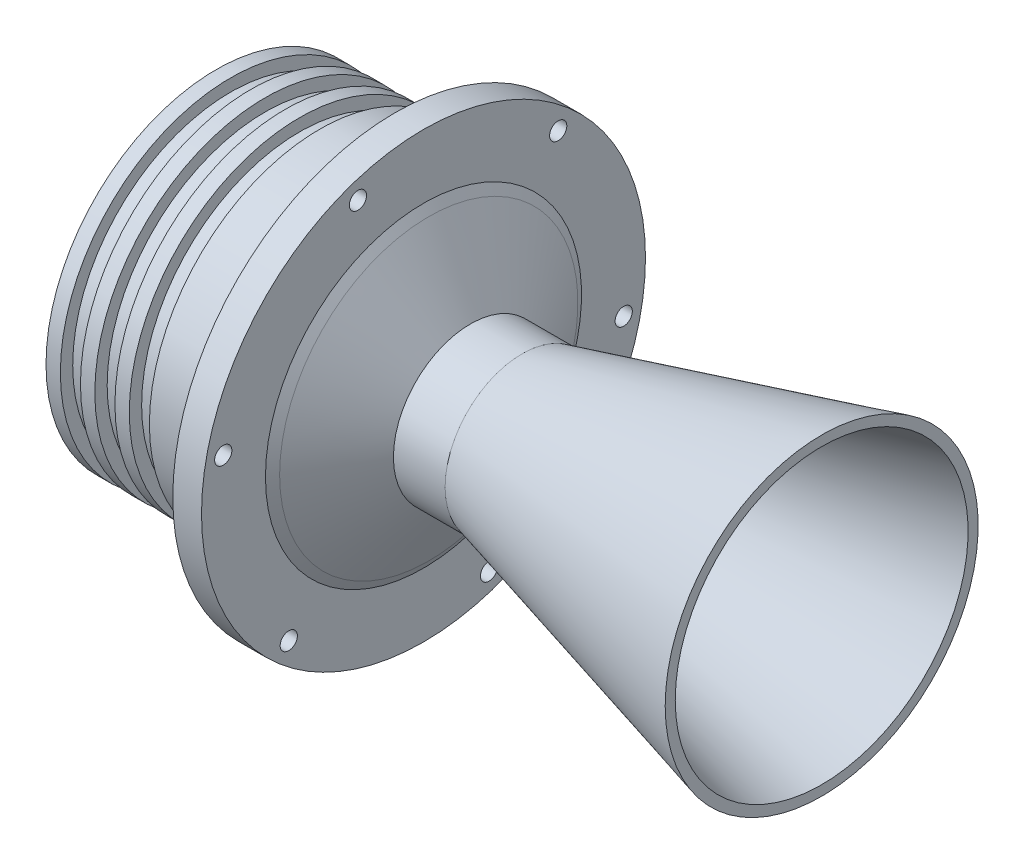
ISO-10303-21;
HEADER;
FILE_DESCRIPTION(('STEP AP214'),'2;1');
FILE_NAME('part.step','',(''),(''),'','','');
FILE_SCHEMA(('AUTOMOTIVE_DESIGN { 1 0 10303 214 1 1 1 1 }'));
ENDSEC;
DATA;
#1=APPLICATION_CONTEXT('core data for automotive mechanical design processes');
#2=APPLICATION_PROTOCOL_DEFINITION('international standard','automotive_design',2000,#1);
#3=PRODUCT_CONTEXT('',#1,'mechanical');
#4=PRODUCT('Part','Part','',(#3));
#5=PRODUCT_RELATED_PRODUCT_CATEGORY('part','',(#4));
#6=PRODUCT_DEFINITION_FORMATION('','',#4);
#7=PRODUCT_DEFINITION_CONTEXT('part definition',#1,'design');
#8=PRODUCT_DEFINITION('design','',#6,#7);
#9=PRODUCT_DEFINITION_SHAPE('','',#8);
#10=(LENGTH_UNIT() NAMED_UNIT(*) SI_UNIT(.MILLI.,.METRE.));
#11=(NAMED_UNIT(*) PLANE_ANGLE_UNIT() SI_UNIT($,.RADIAN.));
#12=(NAMED_UNIT(*) SI_UNIT($,.STERADIAN.) SOLID_ANGLE_UNIT());
#13=UNCERTAINTY_MEASURE_WITH_UNIT(LENGTH_MEASURE(1.E-05),#10,'distance_accuracy_value','');
#14=(GEOMETRIC_REPRESENTATION_CONTEXT(3) GLOBAL_UNCERTAINTY_ASSIGNED_CONTEXT((#13)) GLOBAL_UNIT_ASSIGNED_CONTEXT((#10,
#11,#12)) REPRESENTATION_CONTEXT('',''));
#15=CARTESIAN_POINT('',(0.,0.,0.));
#16=DIRECTION('',(0.,0.,1.));
#17=DIRECTION('',(1.,0.,0.));
#18=AXIS2_PLACEMENT_3D('',#15,#16,#17);
#19=CARTESIAN_POINT('',(-18.0393306872222,0.,0.));
#20=DIRECTION('',(1.,0.,0.));
#21=DIRECTION('',(0.,0.,-1.));
#22=AXIS2_PLACEMENT_3D('',#19,#20,#21);
#23=CONICAL_SURFACE('',#22,17.7679491924311,0.26179938779915);
#24=CARTESIAN_POINT('',(105.960669312778,0.,0.));
#25=DIRECTION('',(-1.,0.,0.));
#26=DIRECTION('',(0.,0.,1.));
#27=AXIS2_PLACEMENT_3D('',#24,#25,#26);
#28=CIRCLE('',#27,50.9936490538905);
#29=CARTESIAN_POINT('',(105.960669312778,0.,50.9936490538905));
#30=VERTEX_POINT('',#29);
#31=EDGE_CURVE('E81',#30,#30,#28,.T.);
#32=ORIENTED_EDGE('',*,*,#31,.F.);
#33=EDGE_LOOP('',(#32));
#34=FACE_BOUND('',#33,.T.);
#35=CARTESIAN_POINT('',(-18.0393306872222,0.,0.));
#36=DIRECTION('',(-1.,0.,0.));
#37=DIRECTION('',(0.,0.,1.));
#38=AXIS2_PLACEMENT_3D('',#35,#36,#37);
#39=CIRCLE('',#38,17.7679491924311);
#40=CARTESIAN_POINT('',(-18.0393306872222,0.,17.7679491924311));
#41=VERTEX_POINT('',#40);
#42=EDGE_CURVE('E10',#41,#41,#39,.T.);
#43=ORIENTED_EDGE('',*,*,#42,.T.);
#44=EDGE_LOOP('',(#43));
#45=FACE_BOUND('',#44,.T.);
#46=ADVANCED_FACE('F33',(#34,#45),#23,.F.);
#47=CARTESIAN_POINT('',(-18.5624081703552,0.,0.));
#48=DIRECTION('',(-1.,0.,0.));
#49=DIRECTION('',(0.,0.,1.));
#50=AXIS2_PLACEMENT_3D('',#47,#48,#49);
#51=TOROIDAL_SURFACE('',#50,18.9465103355456,1.28942484132275);
#52=ORIENTED_EDGE('',*,*,#42,.F.);
#53=EDGE_LOOP('',(#52));
#54=FACE_BOUND('',#53,.T.);
#55=CARTESIAN_POINT('',(-19.2831961369788,0.,0.));
#56=DIRECTION('',(-1.,0.,0.));
#57=DIRECTION('',(0.,0.,1.));
#58=AXIS2_PLACEMENT_3D('',#55,#56,#57);
#59=CIRCLE('',#58,17.877360613294);
#60=CARTESIAN_POINT('',(-19.2831961369788,0.,17.877360613294));
#61=VERTEX_POINT('',#60);
#62=EDGE_CURVE('E40',#61,#61,#59,.T.);
#63=ORIENTED_EDGE('',*,*,#62,.T.);
#64=EDGE_LOOP('',(#63));
#65=FACE_BOUND('',#64,.T.);
#66=ADVANCED_FACE('F305',(#54,#65),#51,.T.);
#67=CARTESIAN_POINT('',(-36.9711818397024,0.,0.));
#68=DIRECTION('',(-1.,0.,0.));
#69=DIRECTION('',(0.,0.,1.));
#70=AXIS2_PLACEMENT_3D('',#67,#68,#69);
#71=CONICAL_SURFACE('',#70,48.5138505339633,1.0471975511966);
#72=ORIENTED_EDGE('',*,*,#62,.F.);
#73=EDGE_LOOP('',(#72));
#74=FACE_BOUND('',#73,.T.);
#75=CARTESIAN_POINT('',(-36.9711818397024,0.,0.));
#76=DIRECTION('',(-1.,0.,0.));
#77=DIRECTION('',(0.,0.,1.));
#78=AXIS2_PLACEMENT_3D('',#75,#76,#77);
#79=CIRCLE('',#78,48.5138505339633);
#80=CARTESIAN_POINT('',(-36.9711818397024,0.,48.5138505339633));
#81=VERTEX_POINT('',#80);
#82=EDGE_CURVE('E45',#81,#81,#79,.T.);
#83=ORIENTED_EDGE('',*,*,#82,.T.);
#84=EDGE_LOOP('',(#83));
#85=FACE_BOUND('',#84,.T.);
#86=ADVANCED_FACE('F155',(#74,#85),#71,.F.);
#87=CARTESIAN_POINT('',(-40.1019276223522,0.,0.));
#88=DIRECTION('',(-1.,0.,0.));
#89=DIRECTION('',(0.,0.,1.));
#90=AXIS2_PLACEMENT_3D('',#87,#88,#89);
#91=TOROIDAL_SURFACE('',#90,45.9802034497686,4.02752240252339);
#92=ORIENTED_EDGE('',*,*,#82,.F.);
#93=EDGE_LOOP('',(#92));
#94=FACE_BOUND('',#93,.T.);
#95=CARTESIAN_POINT('',(-39.8525836880452,0.,0.));
#96=DIRECTION('',(-1.,0.,0.));
#97=DIRECTION('',(0.,0.,1.));
#98=AXIS2_PLACEMENT_3D('',#95,#96,#97);
#99=CIRCLE('',#98,50.);
#100=CARTESIAN_POINT('',(-39.8525836880452,0.,50.));
#101=VERTEX_POINT('',#100);
#102=EDGE_CURVE('E150',#101,#101,#99,.T.);
#103=ORIENTED_EDGE('',*,*,#102,.T.);
#104=EDGE_LOOP('',(#103));
#105=FACE_BOUND('',#104,.T.);
#106=ADVANCED_FACE('F157',(#94,#105),#91,.F.);
#107=CARTESIAN_POINT('',(-113.603789782245,0.,0.));
#108=DIRECTION('',(-1.,0.,0.));
#109=DIRECTION('',(0.,0.,1.));
#110=AXIS2_PLACEMENT_3D('',#107,#108,#109);
#111=CYLINDRICAL_SURFACE('',#110,50.);
#112=ORIENTED_EDGE('',*,*,#102,.F.);
#113=EDGE_LOOP('',(#112));
#114=FACE_BOUND('',#113,.T.);
#115=CARTESIAN_POINT('',(-99.850994621969,0.,0.));
#116=DIRECTION('',(-1.,0.,0.));
#117=DIRECTION('',(0.,0.,1.));
#118=AXIS2_PLACEMENT_3D('',#115,#116,#117);
#119=CIRCLE('',#118,50.);
#120=CARTESIAN_POINT('',(-99.850994621969,0.,50.));
#121=VERTEX_POINT('',#120);
#122=EDGE_CURVE('E147',#121,#121,#119,.T.);
#123=ORIENTED_EDGE('',*,*,#122,.T.);
#124=EDGE_LOOP('',(#123));
#125=FACE_BOUND('',#124,.T.);
#126=ADVANCED_FACE('F160',(#114,#125),#111,.F.);
#127=CARTESIAN_POINT('',(-104.850994621969,0.,0.));
#128=DIRECTION('',(-1.,0.,0.));
#129=DIRECTION('',(0.,0.,1.));
#130=AXIS2_PLACEMENT_3D('',#127,#128,#129);
#131=CONICAL_SURFACE('',#130,59.3,1.07749639460582);
#132=ORIENTED_EDGE('',*,*,#122,.F.);
#133=EDGE_LOOP('',(#132));
#134=FACE_BOUND('',#133,.T.);
#135=CARTESIAN_POINT('',(-104.850994621969,0.,0.));
#136=DIRECTION('',(-1.,0.,0.));
#137=DIRECTION('',(0.,0.,1.));
#138=AXIS2_PLACEMENT_3D('',#135,#136,#137);
#139=CIRCLE('',#138,59.3);
#140=CARTESIAN_POINT('',(-104.850994621969,0.,59.3));
#141=VERTEX_POINT('',#140);
#142=EDGE_CURVE('E144',#141,#141,#139,.T.);
#143=ORIENTED_EDGE('',*,*,#142,.T.);
#144=EDGE_LOOP('',(#143));
#145=FACE_BOUND('',#144,.T.);
#146=ADVANCED_FACE('F166',(#134,#145),#131,.F.);
#147=CARTESIAN_POINT('',(-113.603789782245,0.,0.));
#148=DIRECTION('',(-1.,0.,0.));
#149=DIRECTION('',(0.,0.,1.));
#150=AXIS2_PLACEMENT_3D('',#147,#148,#149);
#151=CYLINDRICAL_SURFACE('',#150,59.3);
#152=ORIENTED_EDGE('',*,*,#142,.F.);
#153=EDGE_LOOP('',(#152));
#154=FACE_BOUND('',#153,.T.);
#155=CARTESIAN_POINT('',(-99.850994621969,0.,0.));
#156=DIRECTION('',(-1.,0.,0.));
#157=DIRECTION('',(0.,0.,1.));
#158=AXIS2_PLACEMENT_3D('',#155,#156,#157);
#159=CIRCLE('',#158,59.3);
#160=CARTESIAN_POINT('',(-99.850994621969,0.,59.3));
#161=VERTEX_POINT('',#160);
#162=EDGE_CURVE('E141',#161,#161,#159,.T.);
#163=ORIENTED_EDGE('',*,*,#162,.T.);
#164=EDGE_LOOP('',(#163));
#165=FACE_BOUND('',#164,.T.);
#166=ADVANCED_FACE('F172',(#154,#165),#151,.T.);
#167=CARTESIAN_POINT('',(-99.850994621969,59.3,0.));
#168=DIRECTION('',(-1.,0.,0.));
#169=DIRECTION('',(0.,0.,1.));
#170=AXIS2_PLACEMENT_3D('',#167,#168,#169);
#171=PLANE('',#170);
#172=ORIENTED_EDGE('',*,*,#162,.F.);
#173=EDGE_LOOP('',(#172));
#174=FACE_BOUND('',#173,.T.);
#175=CARTESIAN_POINT('',(-99.850994621969,0.,0.));
#176=DIRECTION('',(-1.,0.,0.));
#177=DIRECTION('',(0.,0.,1.));
#178=AXIS2_PLACEMENT_3D('',#175,#176,#177);
#179=CIRCLE('',#178,55.);
#180=CARTESIAN_POINT('',(-99.850994621969,0.,55.));
#181=VERTEX_POINT('',#180);
#182=EDGE_CURVE('E138',#181,#181,#179,.T.);
#183=ORIENTED_EDGE('',*,*,#182,.T.);
#184=EDGE_LOOP('',(#183));
#185=FACE_BOUND('',#184,.T.);
#186=ADVANCED_FACE('F178',(#174,#185),#171,.F.);
#187=CARTESIAN_POINT('',(-113.603789782245,0.,0.));
#188=DIRECTION('',(-1.,0.,0.));
#189=DIRECTION('',(0.,0.,1.));
#190=AXIS2_PLACEMENT_3D('',#187,#188,#189);
#191=CYLINDRICAL_SURFACE('',#190,55.);
#192=ORIENTED_EDGE('',*,*,#182,.F.);
#193=EDGE_LOOP('',(#192));
#194=FACE_BOUND('',#193,.T.);
#195=CARTESIAN_POINT('',(-92.850994621969,0.,0.));
#196=DIRECTION('',(-1.,0.,0.));
#197=DIRECTION('',(0.,0.,1.));
#198=AXIS2_PLACEMENT_3D('',#195,#196,#197);
#199=CIRCLE('',#198,55.);
#200=CARTESIAN_POINT('',(-92.850994621969,0.,55.));
#201=VERTEX_POINT('',#200);
#202=EDGE_CURVE('E135',#201,#201,#199,.T.);
#203=ORIENTED_EDGE('',*,*,#202,.T.);
#204=EDGE_LOOP('',(#203));
#205=FACE_BOUND('',#204,.T.);
#206=ADVANCED_FACE('F184',(#194,#205),#191,.T.);
#207=CARTESIAN_POINT('',(-92.850994621969,55.,0.));
#208=DIRECTION('',(1.,0.,0.));
#209=DIRECTION('',(0.,0.,-1.));
#210=AXIS2_PLACEMENT_3D('',#207,#208,#209);
#211=PLANE('',#210);
#212=ORIENTED_EDGE('',*,*,#202,.F.);
#213=EDGE_LOOP('',(#212));
#214=FACE_BOUND('',#213,.T.);
#215=CARTESIAN_POINT('',(-92.850994621969,0.,0.));
#216=DIRECTION('',(-1.,0.,0.));
#217=DIRECTION('',(0.,0.,1.));
#218=AXIS2_PLACEMENT_3D('',#215,#216,#217);
#219=CIRCLE('',#218,59.3);
#220=CARTESIAN_POINT('',(-92.850994621969,0.,59.3));
#221=VERTEX_POINT('',#220);
#222=EDGE_CURVE('E132',#221,#221,#219,.T.);
#223=ORIENTED_EDGE('',*,*,#222,.T.);
#224=EDGE_LOOP('',(#223));
#225=FACE_BOUND('',#224,.T.);
#226=ADVANCED_FACE('F190',(#214,#225),#211,.F.);
#227=CARTESIAN_POINT('',(-113.603789782245,0.,0.));
#228=DIRECTION('',(-1.,0.,0.));
#229=DIRECTION('',(0.,0.,1.));
#230=AXIS2_PLACEMENT_3D('',#227,#228,#229);
#231=CYLINDRICAL_SURFACE('',#230,59.3);
#232=ORIENTED_EDGE('',*,*,#222,.F.);
#233=EDGE_LOOP('',(#232));
#234=FACE_BOUND('',#233,.T.);
#235=CARTESIAN_POINT('',(-87.850994621969,0.,0.));
#236=DIRECTION('',(-1.,0.,0.));
#237=DIRECTION('',(0.,0.,1.));
#238=AXIS2_PLACEMENT_3D('',#235,#236,#237);
#239=CIRCLE('',#238,59.3);
#240=CARTESIAN_POINT('',(-87.850994621969,0.,59.3));
#241=VERTEX_POINT('',#240);
#242=EDGE_CURVE('E129',#241,#241,#239,.T.);
#243=ORIENTED_EDGE('',*,*,#242,.T.);
#244=EDGE_LOOP('',(#243));
#245=FACE_BOUND('',#244,.T.);
#246=ADVANCED_FACE('F196',(#234,#245),#231,.T.);
#247=CARTESIAN_POINT('',(-87.850994621969,59.3,0.));
#248=DIRECTION('',(-1.,0.,0.));
#249=DIRECTION('',(0.,0.,1.));
#250=AXIS2_PLACEMENT_3D('',#247,#248,#249);
#251=PLANE('',#250);
#252=ORIENTED_EDGE('',*,*,#242,.F.);
#253=EDGE_LOOP('',(#252));
#254=FACE_BOUND('',#253,.T.);
#255=CARTESIAN_POINT('',(-87.850994621969,0.,0.));
#256=DIRECTION('',(-1.,0.,0.));
#257=DIRECTION('',(0.,0.,1.));
#258=AXIS2_PLACEMENT_3D('',#255,#256,#257);
#259=CIRCLE('',#258,55.);
#260=CARTESIAN_POINT('',(-87.850994621969,0.,55.));
#261=VERTEX_POINT('',#260);
#262=EDGE_CURVE('E126',#261,#261,#259,.T.);
#263=ORIENTED_EDGE('',*,*,#262,.T.);
#264=EDGE_LOOP('',(#263));
#265=FACE_BOUND('',#264,.T.);
#266=ADVANCED_FACE('F202',(#254,#265),#251,.F.);
#267=CARTESIAN_POINT('',(-113.603789782245,0.,0.));
#268=DIRECTION('',(-1.,0.,0.));
#269=DIRECTION('',(0.,0.,1.));
#270=AXIS2_PLACEMENT_3D('',#267,#268,#269);
#271=CYLINDRICAL_SURFACE('',#270,55.);
#272=ORIENTED_EDGE('',*,*,#262,.F.);
#273=EDGE_LOOP('',(#272));
#274=FACE_BOUND('',#273,.T.);
#275=CARTESIAN_POINT('',(-80.850994621969,0.,0.));
#276=DIRECTION('',(-1.,0.,0.));
#277=DIRECTION('',(0.,0.,1.));
#278=AXIS2_PLACEMENT_3D('',#275,#276,#277);
#279=CIRCLE('',#278,55.);
#280=CARTESIAN_POINT('',(-80.850994621969,0.,55.));
#281=VERTEX_POINT('',#280);
#282=EDGE_CURVE('E123',#281,#281,#279,.T.);
#283=ORIENTED_EDGE('',*,*,#282,.T.);
#284=EDGE_LOOP('',(#283));
#285=FACE_BOUND('',#284,.T.);
#286=ADVANCED_FACE('F208',(#274,#285),#271,.T.);
#287=CARTESIAN_POINT('',(-80.850994621969,55.,0.));
#288=DIRECTION('',(1.,0.,0.));
#289=DIRECTION('',(0.,0.,-1.));
#290=AXIS2_PLACEMENT_3D('',#287,#288,#289);
#291=PLANE('',#290);
#292=ORIENTED_EDGE('',*,*,#282,.F.);
#293=EDGE_LOOP('',(#292));
#294=FACE_BOUND('',#293,.T.);
#295=CARTESIAN_POINT('',(-80.850994621969,0.,0.));
#296=DIRECTION('',(-1.,0.,0.));
#297=DIRECTION('',(0.,0.,1.));
#298=AXIS2_PLACEMENT_3D('',#295,#296,#297);
#299=CIRCLE('',#298,59.3);
#300=CARTESIAN_POINT('',(-80.850994621969,0.,59.3));
#301=VERTEX_POINT('',#300);
#302=EDGE_CURVE('E120',#301,#301,#299,.T.);
#303=ORIENTED_EDGE('',*,*,#302,.T.);
#304=EDGE_LOOP('',(#303));
#305=FACE_BOUND('',#304,.T.);
#306=ADVANCED_FACE('F214',(#294,#305),#291,.F.);
#307=CARTESIAN_POINT('',(-113.603789782245,0.,0.));
#308=DIRECTION('',(-1.,0.,0.));
#309=DIRECTION('',(0.,0.,1.));
#310=AXIS2_PLACEMENT_3D('',#307,#308,#309);
#311=CYLINDRICAL_SURFACE('',#310,59.3);
#312=ORIENTED_EDGE('',*,*,#302,.F.);
#313=EDGE_LOOP('',(#312));
#314=FACE_BOUND('',#313,.T.);
#315=CARTESIAN_POINT('',(-75.850994621969,0.,0.));
#316=DIRECTION('',(-1.,0.,0.));
#317=DIRECTION('',(0.,0.,1.));
#318=AXIS2_PLACEMENT_3D('',#315,#316,#317);
#319=CIRCLE('',#318,59.3);
#320=CARTESIAN_POINT('',(-75.850994621969,0.,59.3));
#321=VERTEX_POINT('',#320);
#322=EDGE_CURVE('E117',#321,#321,#319,.T.);
#323=ORIENTED_EDGE('',*,*,#322,.T.);
#324=EDGE_LOOP('',(#323));
#325=FACE_BOUND('',#324,.T.);
#326=ADVANCED_FACE('F220',(#314,#325),#311,.T.);
#327=CARTESIAN_POINT('',(-75.850994621969,59.3,0.));
#328=DIRECTION('',(-1.,0.,0.));
#329=DIRECTION('',(0.,0.,1.));
#330=AXIS2_PLACEMENT_3D('',#327,#328,#329);
#331=PLANE('',#330);
#332=ORIENTED_EDGE('',*,*,#322,.F.);
#333=EDGE_LOOP('',(#332));
#334=FACE_BOUND('',#333,.T.);
#335=CARTESIAN_POINT('',(-75.850994621969,0.,0.));
#336=DIRECTION('',(-1.,0.,0.));
#337=DIRECTION('',(0.,0.,1.));
#338=AXIS2_PLACEMENT_3D('',#335,#336,#337);
#339=CIRCLE('',#338,55.);
#340=CARTESIAN_POINT('',(-75.850994621969,0.,55.));
#341=VERTEX_POINT('',#340);
#342=EDGE_CURVE('E114',#341,#341,#339,.T.);
#343=ORIENTED_EDGE('',*,*,#342,.T.);
#344=EDGE_LOOP('',(#343));
#345=FACE_BOUND('',#344,.T.);
#346=ADVANCED_FACE('F226',(#334,#345),#331,.F.);
#347=CARTESIAN_POINT('',(-113.603789782245,0.,0.));
#348=DIRECTION('',(-1.,0.,0.));
#349=DIRECTION('',(0.,0.,1.));
#350=AXIS2_PLACEMENT_3D('',#347,#348,#349);
#351=CYLINDRICAL_SURFACE('',#350,55.);
#352=ORIENTED_EDGE('',*,*,#342,.F.);
#353=EDGE_LOOP('',(#352));
#354=FACE_BOUND('',#353,.T.);
#355=CARTESIAN_POINT('',(-68.850994621969,0.,0.));
#356=DIRECTION('',(-1.,0.,0.));
#357=DIRECTION('',(0.,0.,1.));
#358=AXIS2_PLACEMENT_3D('',#355,#356,#357);
#359=CIRCLE('',#358,55.);
#360=CARTESIAN_POINT('',(-68.850994621969,0.,55.));
#361=VERTEX_POINT('',#360);
#362=EDGE_CURVE('E111',#361,#361,#359,.T.);
#363=ORIENTED_EDGE('',*,*,#362,.T.);
#364=EDGE_LOOP('',(#363));
#365=FACE_BOUND('',#364,.T.);
#366=ADVANCED_FACE('F232',(#354,#365),#351,.T.);
#367=CARTESIAN_POINT('',(-68.850994621969,55.,0.));
#368=DIRECTION('',(1.,0.,0.));
#369=DIRECTION('',(0.,0.,-1.));
#370=AXIS2_PLACEMENT_3D('',#367,#368,#369);
#371=PLANE('',#370);
#372=ORIENTED_EDGE('',*,*,#362,.F.);
#373=EDGE_LOOP('',(#372));
#374=FACE_BOUND('',#373,.T.);
#375=CARTESIAN_POINT('',(-68.850994621969,0.,0.));
#376=DIRECTION('',(-1.,0.,0.));
#377=DIRECTION('',(0.,0.,1.));
#378=AXIS2_PLACEMENT_3D('',#375,#376,#377);
#379=CIRCLE('',#378,59.3);
#380=CARTESIAN_POINT('',(-68.850994621969,0.,59.3));
#381=VERTEX_POINT('',#380);
#382=EDGE_CURVE('E108',#381,#381,#379,.T.);
#383=ORIENTED_EDGE('',*,*,#382,.T.);
#384=EDGE_LOOP('',(#383));
#385=FACE_BOUND('',#384,.T.);
#386=ADVANCED_FACE('F238',(#374,#385),#371,.F.);
#387=CARTESIAN_POINT('',(-113.603789782245,0.,0.));
#388=DIRECTION('',(-1.,0.,0.));
#389=DIRECTION('',(0.,0.,1.));
#390=AXIS2_PLACEMENT_3D('',#387,#388,#389);
#391=CYLINDRICAL_SURFACE('',#390,59.3);
#392=ORIENTED_EDGE('',*,*,#382,.F.);
#393=EDGE_LOOP('',(#392));
#394=FACE_BOUND('',#393,.T.);
#395=CARTESIAN_POINT('',(-42.6997040782631,0.,0.));
#396=DIRECTION('',(-1.,0.,0.));
#397=DIRECTION('',(0.,0.,1.));
#398=AXIS2_PLACEMENT_3D('',#395,#396,#397);
#399=CIRCLE('',#398,59.3);
#400=CARTESIAN_POINT('',(-42.6997040782631,0.,59.3));
#401=VERTEX_POINT('',#400);
#402=EDGE_CURVE('E105',#401,#401,#399,.T.);
#403=ORIENTED_EDGE('',*,*,#402,.T.);
#404=EDGE_LOOP('',(#403));
#405=FACE_BOUND('',#404,.T.);
#406=ADVANCED_FACE('F244',(#394,#405),#391,.T.);
#407=CARTESIAN_POINT('',(-42.6997040782631,77.3,0.));
#408=DIRECTION('',(1.,0.,0.));
#409=DIRECTION('',(0.,0.,-1.));
#410=AXIS2_PLACEMENT_3D('',#407,#408,#409);
#411=PLANE('',#410);
#412=CARTESIAN_POINT('',(-42.6997040782631,13.9056527722642,69.7269160437863));
#413=DIRECTION('',(1.,0.,0.));
#414=DIRECTION('',(0.,0.,-1.));
#415=AXIS2_PLACEMENT_3D('',#412,#413,#414);
#416=CIRCLE('',#415,3.00000000000001);
#417=CARTESIAN_POINT('',(-42.6997040782631,13.9056527722642,66.7269160437863));
#418=VERTEX_POINT('',#417);
#419=EDGE_CURVE('E78',#418,#418,#416,.F.);
#420=ORIENTED_EDGE('',*,*,#419,.F.);
#421=EDGE_LOOP('',(#420));
#422=FACE_BOUND('',#421,.T.);
#423=CARTESIAN_POINT('',(-42.6997040782631,-53.4324542353316,46.9061065788794));
#424=DIRECTION('',(1.,0.,0.));
#425=DIRECTION('',(0.,0.,-1.));
#426=AXIS2_PLACEMENT_3D('',#423,#424,#425);
#427=CIRCLE('',#426,3.);
#428=CARTESIAN_POINT('',(-42.6997040782631,-53.4324542353316,43.9061065788794));
#429=VERTEX_POINT('',#428);
#430=EDGE_CURVE('E66',#429,#429,#427,.F.);
#431=ORIENTED_EDGE('',*,*,#430,.F.);
#432=EDGE_LOOP('',(#431));
#433=FACE_BOUND('',#432,.T.);
#434=CARTESIAN_POINT('',(-42.6997040782631,-67.3381070075958,-22.8208094649068));
#435=DIRECTION('',(1.,0.,0.));
#436=DIRECTION('',(0.,0.,-1.));
#437=AXIS2_PLACEMENT_3D('',#434,#435,#436);
#438=CIRCLE('',#437,3.);
#439=CARTESIAN_POINT('',(-42.6997040782631,-67.3381070075958,-25.8208094649068));
#440=VERTEX_POINT('',#439);
#441=EDGE_CURVE('E63',#440,#440,#438,.F.);
#442=ORIENTED_EDGE('',*,*,#441,.F.);
#443=EDGE_LOOP('',(#442));
#444=FACE_BOUND('',#443,.T.);
#445=CARTESIAN_POINT('',(-42.6997040782631,-13.9056527722643,-69.7269160437863));
#446=DIRECTION('',(1.,0.,0.));
#447=DIRECTION('',(0.,0.,-1.));
#448=AXIS2_PLACEMENT_3D('',#445,#446,#447);
#449=CIRCLE('',#448,3.00000000000001);
#450=CARTESIAN_POINT('',(-42.6997040782631,-13.9056527722643,-72.7269160437863));
#451=VERTEX_POINT('',#450);
#452=EDGE_CURVE('E60',#451,#451,#449,.F.);
#453=ORIENTED_EDGE('',*,*,#452,.F.);
#454=EDGE_LOOP('',(#453));
#455=FACE_BOUND('',#454,.T.);
#456=CARTESIAN_POINT('',(-42.6997040782631,53.4324542353316,-46.9061065788795));
#457=DIRECTION('',(1.,0.,0.));
#458=DIRECTION('',(0.,0.,-1.));
#459=AXIS2_PLACEMENT_3D('',#456,#457,#458);
#460=CIRCLE('',#459,3.);
#461=CARTESIAN_POINT('',(-42.6997040782631,53.4324542353316,-49.9061065788795));
#462=VERTEX_POINT('',#461);
#463=EDGE_CURVE('E56',#462,#462,#460,.F.);
#464=ORIENTED_EDGE('',*,*,#463,.F.);
#465=EDGE_LOOP('',(#464));
#466=FACE_BOUND('',#465,.T.);
#467=CARTESIAN_POINT('',(-42.6997040782631,67.3381070075958,22.8208094649068));
#468=DIRECTION('',(1.,0.,0.));
#469=DIRECTION('',(0.,0.,-1.));
#470=AXIS2_PLACEMENT_3D('',#467,#468,#469);
#471=CIRCLE('',#470,3.);
#472=CARTESIAN_POINT('',(-42.6997040782631,67.3381070075958,19.8208094649068));
#473=VERTEX_POINT('',#472);
#474=EDGE_CURVE('E52',#473,#473,#471,.F.);
#475=ORIENTED_EDGE('',*,*,#474,.F.);
#476=EDGE_LOOP('',(#475));
#477=FACE_BOUND('',#476,.T.);
#478=ORIENTED_EDGE('',*,*,#402,.F.);
#479=EDGE_LOOP('',(#478));
#480=FACE_BOUND('',#479,.T.);
#481=CARTESIAN_POINT('',(-42.6997040782631,0.,0.));
#482=DIRECTION('',(-1.,0.,0.));
#483=DIRECTION('',(0.,0.,1.));
#484=AXIS2_PLACEMENT_3D('',#481,#482,#483);
#485=CIRCLE('',#484,77.3);
#486=CARTESIAN_POINT('',(-42.6997040782631,0.,77.3));
#487=VERTEX_POINT('',#486);
#488=EDGE_CURVE('E102',#487,#487,#485,.T.);
#489=ORIENTED_EDGE('',*,*,#488,.T.);
#490=EDGE_LOOP('',(#489));
#491=FACE_BOUND('',#490,.T.);
#492=ADVANCED_FACE('F250',(#422,#433,#444,#455,#466,#477,#480,#491),#411,.F.);
#493=CARTESIAN_POINT('',(-113.603789782245,0.,0.));
#494=DIRECTION('',(-1.,0.,0.));
#495=DIRECTION('',(0.,0.,1.));
#496=AXIS2_PLACEMENT_3D('',#493,#494,#495);
#497=CYLINDRICAL_SURFACE('',#496,77.3);
#498=ORIENTED_EDGE('',*,*,#488,.F.);
#499=EDGE_LOOP('',(#498));
#500=FACE_BOUND('',#499,.T.);
#501=CARTESIAN_POINT('',(-32.6997040782631,0.,0.));
#502=DIRECTION('',(-1.,0.,0.));
#503=DIRECTION('',(0.,0.,1.));
#504=AXIS2_PLACEMENT_3D('',#501,#502,#503);
#505=CIRCLE('',#504,77.3);
#506=CARTESIAN_POINT('',(-32.6997040782631,0.,77.3));
#507=VERTEX_POINT('',#506);
#508=EDGE_CURVE('E99',#507,#507,#505,.T.);
#509=ORIENTED_EDGE('',*,*,#508,.T.);
#510=EDGE_LOOP('',(#509));
#511=FACE_BOUND('',#510,.T.);
#512=ADVANCED_FACE('F256',(#500,#511),#497,.T.);
#513=CARTESIAN_POINT('',(-32.6997040782631,55.0335236832929,0.));
#514=DIRECTION('',(-1.,0.,0.));
#515=DIRECTION('',(0.,0.,1.));
#516=AXIS2_PLACEMENT_3D('',#513,#514,#515);
#517=PLANE('',#516);
#518=CARTESIAN_POINT('',(-32.6997040782631,13.9056527722642,69.7269160437863));
#519=DIRECTION('',(-1.,0.,0.));
#520=DIRECTION('',(0.,0.,1.));
#521=AXIS2_PLACEMENT_3D('',#518,#519,#520);
#522=CIRCLE('',#521,3.00000000000001);
#523=CARTESIAN_POINT('',(-32.6997040782631,13.9056527722642,72.7269160437863));
#524=VERTEX_POINT('',#523);
#525=EDGE_CURVE('E36',#524,#524,#522,.F.);
#526=ORIENTED_EDGE('',*,*,#525,.F.);
#527=EDGE_LOOP('',(#526));
#528=FACE_BOUND('',#527,.T.);
#529=CARTESIAN_POINT('',(-32.6997040782631,-53.4324542353316,46.9061065788794));
#530=DIRECTION('',(-1.,0.,0.));
#531=DIRECTION('',(0.,0.,1.));
#532=AXIS2_PLACEMENT_3D('',#529,#530,#531);
#533=CIRCLE('',#532,3.);
#534=CARTESIAN_POINT('',(-32.6997040782631,-53.4324542353316,49.9061065788795));
#535=VERTEX_POINT('',#534);
#536=EDGE_CURVE('E64',#535,#535,#533,.F.);
#537=ORIENTED_EDGE('',*,*,#536,.F.);
#538=EDGE_LOOP('',(#537));
#539=FACE_BOUND('',#538,.T.);
#540=CARTESIAN_POINT('',(-32.6997040782631,-67.3381070075958,-22.8208094649068));
#541=DIRECTION('',(-1.,0.,0.));
#542=DIRECTION('',(0.,0.,1.));
#543=AXIS2_PLACEMENT_3D('',#540,#541,#542);
#544=CIRCLE('',#543,3.);
#545=CARTESIAN_POINT('',(-32.6997040782631,-67.3381070075958,-19.8208094649068));
#546=VERTEX_POINT('',#545);
#547=EDGE_CURVE('E61',#546,#546,#544,.F.);
#548=ORIENTED_EDGE('',*,*,#547,.F.);
#549=EDGE_LOOP('',(#548));
#550=FACE_BOUND('',#549,.T.);
#551=CARTESIAN_POINT('',(-32.6997040782631,-13.9056527722643,-69.7269160437863));
#552=DIRECTION('',(-1.,0.,0.));
#553=DIRECTION('',(0.,0.,1.));
#554=AXIS2_PLACEMENT_3D('',#551,#552,#553);
#555=CIRCLE('',#554,3.00000000000001);
#556=CARTESIAN_POINT('',(-32.6997040782631,-13.9056527722643,-66.7269160437863));
#557=VERTEX_POINT('',#556);
#558=EDGE_CURVE('E57',#557,#557,#555,.F.);
#559=ORIENTED_EDGE('',*,*,#558,.F.);
#560=EDGE_LOOP('',(#559));
#561=FACE_BOUND('',#560,.T.);
#562=CARTESIAN_POINT('',(-32.6997040782631,53.4324542353316,-46.9061065788795));
#563=DIRECTION('',(-1.,0.,0.));
#564=DIRECTION('',(0.,0.,1.));
#565=AXIS2_PLACEMENT_3D('',#562,#563,#564);
#566=CIRCLE('',#565,3.);
#567=CARTESIAN_POINT('',(-32.6997040782631,53.4324542353316,-43.9061065788795));
#568=VERTEX_POINT('',#567);
#569=EDGE_CURVE('E53',#568,#568,#566,.F.);
#570=ORIENTED_EDGE('',*,*,#569,.F.);
#571=EDGE_LOOP('',(#570));
#572=FACE_BOUND('',#571,.T.);
#573=CARTESIAN_POINT('',(-32.6997040782631,67.3381070075958,22.8208094649068));
#574=DIRECTION('',(-1.,0.,0.));
#575=DIRECTION('',(0.,0.,1.));
#576=AXIS2_PLACEMENT_3D('',#573,#574,#575);
#577=CIRCLE('',#576,3.);
#578=CARTESIAN_POINT('',(-32.6997040782631,67.3381070075958,25.8208094649068));
#579=VERTEX_POINT('',#578);
#580=EDGE_CURVE('E49',#579,#579,#577,.F.);
#581=ORIENTED_EDGE('',*,*,#580,.F.);
#582=EDGE_LOOP('',(#581));
#583=FACE_BOUND('',#582,.T.);
#584=ORIENTED_EDGE('',*,*,#508,.F.);
#585=EDGE_LOOP('',(#584));
#586=FACE_BOUND('',#585,.T.);
#587=CARTESIAN_POINT('',(-32.6997040782631,0.,0.));
#588=DIRECTION('',(-1.,0.,0.));
#589=DIRECTION('',(0.,0.,1.));
#590=AXIS2_PLACEMENT_3D('',#587,#588,#589);
#591=CIRCLE('',#590,55.0335236832929);
#592=CARTESIAN_POINT('',(-32.6997040782631,0.,55.0335236832929));
#593=VERTEX_POINT('',#592);
#594=EDGE_CURVE('E96',#593,#593,#591,.T.);
#595=ORIENTED_EDGE('',*,*,#594,.T.);
#596=EDGE_LOOP('',(#595));
#597=FACE_BOUND('',#596,.T.);
#598=ADVANCED_FACE('F263',(#528,#539,#550,#561,#572,#583,#586,#597),#517,.F.);
#599=CARTESIAN_POINT('',(-30.8641826354231,0.,0.));
#600=DIRECTION('',(-1.,0.,0.));
#601=DIRECTION('',(0.,0.,1.));
#602=AXIS2_PLACEMENT_3D('',#599,#600,#601);
#603=CONICAL_SURFACE('',#602,51.9362176303688,1.03582194155095);
#604=ORIENTED_EDGE('',*,*,#594,.F.);
#605=EDGE_LOOP('',(#604));
#606=FACE_BOUND('',#605,.T.);
#607=CARTESIAN_POINT('',(-30.8641826354231,0.,0.));
#608=DIRECTION('',(-1.,0.,0.));
#609=DIRECTION('',(0.,0.,1.));
#610=AXIS2_PLACEMENT_3D('',#607,#608,#609);
#611=CIRCLE('',#610,51.9362176303688);
#612=CARTESIAN_POINT('',(-30.8641826354231,0.,51.9362176303688));
#613=VERTEX_POINT('',#612);
#614=EDGE_CURVE('E93',#613,#613,#611,.T.);
#615=ORIENTED_EDGE('',*,*,#614,.T.);
#616=EDGE_LOOP('',(#615));
#617=FACE_BOUND('',#616,.T.);
#618=ADVANCED_FACE('F269',(#606,#617),#603,.T.);
#619=CARTESIAN_POINT('',(-16.359721016783,0.,0.));
#620=DIRECTION('',(-1.,0.,0.));
#621=DIRECTION('',(0.,0.,1.));
#622=AXIS2_PLACEMENT_3D('',#619,#620,#621);
#623=CONICAL_SURFACE('',#622,26.8137531704513,1.0471975511966);
#624=ORIENTED_EDGE('',*,*,#614,.F.);
#625=EDGE_LOOP('',(#624));
#626=FACE_BOUND('',#625,.T.);
#627=CARTESIAN_POINT('',(-16.359721016783,0.,0.));
#628=DIRECTION('',(-1.,0.,0.));
#629=DIRECTION('',(0.,0.,1.));
#630=AXIS2_PLACEMENT_3D('',#627,#628,#629);
#631=CIRCLE('',#630,26.8137531704513);
#632=CARTESIAN_POINT('',(-16.359721016783,0.,26.8137531704513));
#633=VERTEX_POINT('',#632);
#634=EDGE_CURVE('E90',#633,#633,#631,.T.);
#635=ORIENTED_EDGE('',*,*,#634,.T.);
#636=EDGE_LOOP('',(#635));
#637=FACE_BOUND('',#636,.T.);
#638=ADVANCED_FACE('F276',(#626,#637),#623,.T.);
#639=CARTESIAN_POINT('',(-113.603789782245,0.,0.));
#640=DIRECTION('',(-1.,0.,0.));
#641=DIRECTION('',(0.,0.,1.));
#642=AXIS2_PLACEMENT_3D('',#639,#640,#641);
#643=CYLINDRICAL_SURFACE('',#642,26.8137531704513);
#644=ORIENTED_EDGE('',*,*,#634,.F.);
#645=EDGE_LOOP('',(#644));
#646=FACE_BOUND('',#645,.T.);
#647=CARTESIAN_POINT('',(1.64027898321707,0.,0.));
#648=DIRECTION('',(-1.,0.,0.));
#649=DIRECTION('',(0.,0.,1.));
#650=AXIS2_PLACEMENT_3D('',#647,#648,#649);
#651=CIRCLE('',#650,26.8137531704513);
#652=CARTESIAN_POINT('',(1.64027898321707,0.,26.8137531704513));
#653=VERTEX_POINT('',#652);
#654=EDGE_CURVE('E87',#653,#653,#651,.T.);
#655=ORIENTED_EDGE('',*,*,#654,.T.);
#656=EDGE_LOOP('',(#655));
#657=FACE_BOUND('',#656,.T.);
#658=ADVANCED_FACE('F282',(#646,#657),#643,.T.);
#659=CARTESIAN_POINT('',(105.960669312778,0.,0.));
#660=DIRECTION('',(1.,0.,0.));
#661=DIRECTION('',(0.,0.,-1.));
#662=AXIS2_PLACEMENT_3D('',#659,#660,#661);
#663=CONICAL_SURFACE('',#662,54.4936490538904,0.259359126831441);
#664=ORIENTED_EDGE('',*,*,#654,.F.);
#665=EDGE_LOOP('',(#664));
#666=FACE_BOUND('',#665,.T.);
#667=CARTESIAN_POINT('',(105.960669312778,0.,0.));
#668=DIRECTION('',(-1.,0.,0.));
#669=DIRECTION('',(0.,0.,1.));
#670=AXIS2_PLACEMENT_3D('',#667,#668,#669);
#671=CIRCLE('',#670,54.4936490538904);
#672=CARTESIAN_POINT('',(105.960669312778,0.,54.4936490538904));
#673=VERTEX_POINT('',#672);
#674=EDGE_CURVE('E84',#673,#673,#671,.T.);
#675=ORIENTED_EDGE('',*,*,#674,.T.);
#676=EDGE_LOOP('',(#675));
#677=FACE_BOUND('',#676,.T.);
#678=ADVANCED_FACE('F288',(#666,#677),#663,.T.);
#679=CARTESIAN_POINT('',(105.960669312778,50.9936490538905,0.));
#680=DIRECTION('',(-1.,0.,0.));
#681=DIRECTION('',(0.,0.,1.));
#682=AXIS2_PLACEMENT_3D('',#679,#680,#681);
#683=PLANE('',#682);
#684=ORIENTED_EDGE('',*,*,#674,.F.);
#685=EDGE_LOOP('',(#684));
#686=FACE_BOUND('',#685,.T.);
#687=ORIENTED_EDGE('',*,*,#31,.T.);
#688=EDGE_LOOP('',(#687));
#689=FACE_BOUND('',#688,.T.);
#690=ADVANCED_FACE('F294',(#686,#689),#683,.F.);
#691=CARTESIAN_POINT('',(10.,67.3381070075958,22.8208094649068));
#692=DIRECTION('',(-1.,0.,0.));
#693=DIRECTION('',(0.,0.,1.));
#694=AXIS2_PLACEMENT_3D('',#691,#692,#693);
#695=CYLINDRICAL_SURFACE('',#694,3.);
#696=ORIENTED_EDGE('',*,*,#580,.T.);
#697=EDGE_LOOP('',(#696));
#698=FACE_BOUND('',#697,.T.);
#699=ORIENTED_EDGE('',*,*,#474,.T.);
#700=EDGE_LOOP('',(#699));
#701=FACE_BOUND('',#700,.T.);
#702=ADVANCED_FACE('F300',(#698,#701),#695,.F.);
#703=CARTESIAN_POINT('',(10.,53.4324542353316,-46.9061065788795));
#704=DIRECTION('',(-1.,0.,0.));
#705=DIRECTION('',(0.,0.,1.));
#706=AXIS2_PLACEMENT_3D('',#703,#704,#705);
#707=CYLINDRICAL_SURFACE('',#706,3.);
#708=ORIENTED_EDGE('',*,*,#569,.T.);
#709=EDGE_LOOP('',(#708));
#710=FACE_BOUND('',#709,.T.);
#711=ORIENTED_EDGE('',*,*,#463,.T.);
#712=EDGE_LOOP('',(#711));
#713=FACE_BOUND('',#712,.T.);
#714=ADVANCED_FACE('F319',(#710,#713),#707,.F.);
#715=CARTESIAN_POINT('',(10.,-13.9056527722643,-69.7269160437863));
#716=DIRECTION('',(-1.,0.,0.));
#717=DIRECTION('',(0.,0.,1.));
#718=AXIS2_PLACEMENT_3D('',#715,#716,#717);
#719=CYLINDRICAL_SURFACE('',#718,3.00000000000001);
#720=ORIENTED_EDGE('',*,*,#558,.T.);
#721=EDGE_LOOP('',(#720));
#722=FACE_BOUND('',#721,.T.);
#723=ORIENTED_EDGE('',*,*,#452,.T.);
#724=EDGE_LOOP('',(#723));
#725=FACE_BOUND('',#724,.T.);
#726=ADVANCED_FACE('F323',(#722,#725),#719,.F.);
#727=CARTESIAN_POINT('',(10.,-67.3381070075958,-22.8208094649068));
#728=DIRECTION('',(-1.,0.,0.));
#729=DIRECTION('',(0.,0.,1.));
#730=AXIS2_PLACEMENT_3D('',#727,#728,#729);
#731=CYLINDRICAL_SURFACE('',#730,3.);
#732=ORIENTED_EDGE('',*,*,#547,.T.);
#733=EDGE_LOOP('',(#732));
#734=FACE_BOUND('',#733,.T.);
#735=ORIENTED_EDGE('',*,*,#441,.T.);
#736=EDGE_LOOP('',(#735));
#737=FACE_BOUND('',#736,.T.);
#738=ADVANCED_FACE('F327',(#734,#737),#731,.F.);
#739=CARTESIAN_POINT('',(10.,-53.4324542353316,46.9061065788794));
#740=DIRECTION('',(-1.,0.,0.));
#741=DIRECTION('',(0.,0.,1.));
#742=AXIS2_PLACEMENT_3D('',#739,#740,#741);
#743=CYLINDRICAL_SURFACE('',#742,3.);
#744=ORIENTED_EDGE('',*,*,#536,.T.);
#745=EDGE_LOOP('',(#744));
#746=FACE_BOUND('',#745,.T.);
#747=ORIENTED_EDGE('',*,*,#430,.T.);
#748=EDGE_LOOP('',(#747));
#749=FACE_BOUND('',#748,.T.);
#750=ADVANCED_FACE('F331',(#746,#749),#743,.F.);
#751=CARTESIAN_POINT('',(10.,13.9056527722642,69.7269160437863));
#752=DIRECTION('',(-1.,0.,0.));
#753=DIRECTION('',(0.,0.,1.));
#754=AXIS2_PLACEMENT_3D('',#751,#752,#753);
#755=CYLINDRICAL_SURFACE('',#754,3.00000000000001);
#756=ORIENTED_EDGE('',*,*,#525,.T.);
#757=EDGE_LOOP('',(#756));
#758=FACE_BOUND('',#757,.T.);
#759=ORIENTED_EDGE('',*,*,#419,.T.);
#760=EDGE_LOOP('',(#759));
#761=FACE_BOUND('',#760,.T.);
#762=ADVANCED_FACE('F335',(#758,#761),#755,.F.);
#763=CLOSED_SHELL('',(#46,#66,#86,#106,#126,#146,#166,#186,#206,#226,#246,#266,#286,#306,#326,
#346,#366,#386,#406,#492,#512,#598,#618,#638,#658,#678,#690,#702,#714,#726,#738,#750,#762));
#764=MANIFOLD_SOLID_BREP('B2',#763);
#765=ADVANCED_BREP_SHAPE_REPRESENTATION('',(#18,#764),#14);
#766=SHAPE_DEFINITION_REPRESENTATION(#9,#765);
ENDSEC;
END-ISO-10303-21;
